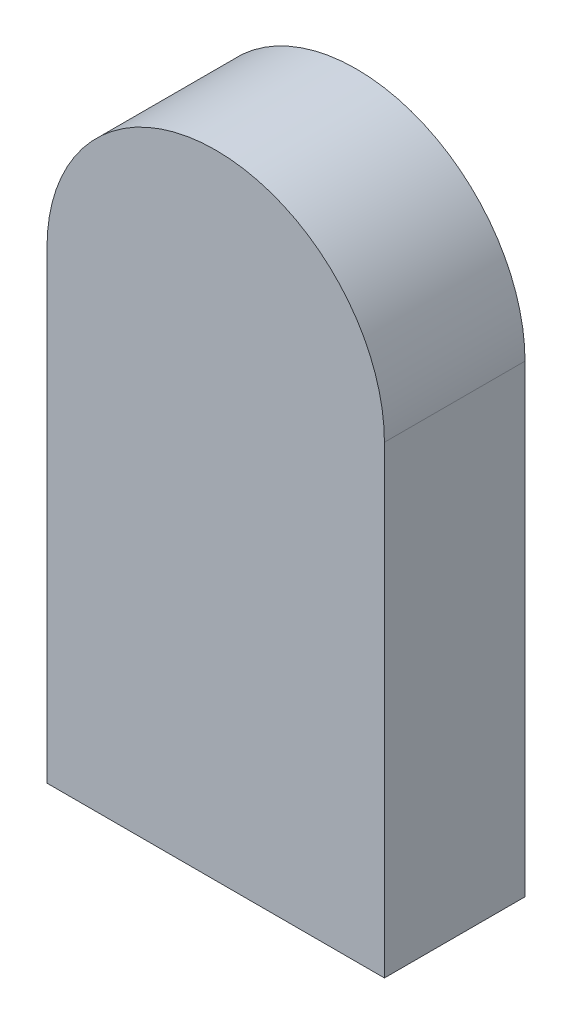
ISO-10303-21;
HEADER;
FILE_DESCRIPTION(('STEP AP214'),'2;1');
FILE_NAME('part.step','',(''),(''),'','','');
FILE_SCHEMA(('AUTOMOTIVE_DESIGN { 1 0 10303 214 1 1 1 1 }'));
ENDSEC;
DATA;
#1=APPLICATION_CONTEXT('core data for automotive mechanical design processes');
#2=APPLICATION_PROTOCOL_DEFINITION('international standard','automotive_design',2000,#1);
#3=PRODUCT_CONTEXT('',#1,'mechanical');
#4=PRODUCT('Part','Part','',(#3));
#5=PRODUCT_RELATED_PRODUCT_CATEGORY('part','',(#4));
#6=PRODUCT_DEFINITION_FORMATION('','',#4);
#7=PRODUCT_DEFINITION_CONTEXT('part definition',#1,'design');
#8=PRODUCT_DEFINITION('design','',#6,#7);
#9=PRODUCT_DEFINITION_SHAPE('','',#8);
#10=(LENGTH_UNIT() NAMED_UNIT(*) SI_UNIT(.MILLI.,.METRE.));
#11=(NAMED_UNIT(*) PLANE_ANGLE_UNIT() SI_UNIT($,.RADIAN.));
#12=(NAMED_UNIT(*) SI_UNIT($,.STERADIAN.) SOLID_ANGLE_UNIT());
#13=UNCERTAINTY_MEASURE_WITH_UNIT(LENGTH_MEASURE(1.E-05),#10,'distance_accuracy_value','');
#14=(GEOMETRIC_REPRESENTATION_CONTEXT(3) GLOBAL_UNCERTAINTY_ASSIGNED_CONTEXT((#13)) GLOBAL_UNIT_ASSIGNED_CONTEXT((#10,
#11,#12)) REPRESENTATION_CONTEXT('',''));
#15=CARTESIAN_POINT('',(0.,0.,0.));
#16=DIRECTION('',(0.,0.,1.));
#17=DIRECTION('',(1.,0.,0.));
#18=AXIS2_PLACEMENT_3D('',#15,#16,#17);
#19=CARTESIAN_POINT('',(1.13,-4.05,0.));
#20=DIRECTION('',(0.,1.,0.));
#21=DIRECTION('',(1.,0.,0.));
#22=AXIS2_PLACEMENT_3D('',#19,#20,#21);
#23=PLANE('',#22);
#24=DIRECTION('',(1.,0.,0.));
#25=VECTOR('',#24,1.);
#26=CARTESIAN_POINT('',(1.13,-4.05,0.));
#27=LINE('',#26,#25);
#28=CARTESIAN_POINT('',(1.13,-4.05,0.));
#29=VERTEX_POINT('',#28);
#30=CARTESIAN_POINT('',(1.37,-4.05,0.));
#31=VERTEX_POINT('',#30);
#32=EDGE_CURVE('E11',#29,#31,#27,.T.);
#33=ORIENTED_EDGE('',*,*,#32,.T.);
#34=DIRECTION('',(0.,0.,1.));
#35=VECTOR('',#34,1.);
#36=CARTESIAN_POINT('',(1.37,-4.05,0.));
#37=LINE('',#36,#35);
#38=CARTESIAN_POINT('',(1.37,-4.05,0.1));
#39=VERTEX_POINT('',#38);
#40=EDGE_CURVE('E24',#31,#39,#37,.T.);
#41=ORIENTED_EDGE('',*,*,#40,.T.);
#42=DIRECTION('',(1.,0.,0.));
#43=VECTOR('',#42,1.);
#44=CARTESIAN_POINT('',(1.13,-4.05,0.1));
#45=LINE('',#44,#43);
#46=CARTESIAN_POINT('',(1.13,-4.05,0.1));
#47=VERTEX_POINT('',#46);
#48=EDGE_CURVE('E87',#47,#39,#45,.T.);
#49=ORIENTED_EDGE('',*,*,#48,.F.);
#50=DIRECTION('',(0.,0.,1.));
#51=VECTOR('',#50,1.);
#52=CARTESIAN_POINT('',(1.13,-4.05,0.));
#53=LINE('',#52,#51);
#54=EDGE_CURVE('E36',#29,#47,#53,.T.);
#55=ORIENTED_EDGE('',*,*,#54,.F.);
#56=EDGE_LOOP('',(#33,#41,#49,#55));
#57=FACE_BOUND('',#56,.T.);
#58=ADVANCED_FACE('F17',(#57),#23,.F.);
#59=CARTESIAN_POINT('',(1.37,-4.05,0.));
#60=DIRECTION('',(-1.,0.,0.));
#61=DIRECTION('',(0.,1.,0.));
#62=AXIS2_PLACEMENT_3D('',#59,#60,#61);
#63=PLANE('',#62);
#64=DIRECTION('',(0.,1.,0.));
#65=VECTOR('',#64,1.);
#66=CARTESIAN_POINT('',(1.37,-4.05,0.));
#67=LINE('',#66,#65);
#68=CARTESIAN_POINT('',(1.37,-3.72,0.));
#69=VERTEX_POINT('',#68);
#70=EDGE_CURVE('E84',#31,#69,#67,.T.);
#71=ORIENTED_EDGE('',*,*,#70,.T.);
#72=DIRECTION('',(0.,0.,1.));
#73=VECTOR('',#72,1.);
#74=CARTESIAN_POINT('',(1.37,-3.72,0.));
#75=LINE('',#74,#73);
#76=CARTESIAN_POINT('',(1.37,-3.72,0.1));
#77=VERTEX_POINT('',#76);
#78=EDGE_CURVE('E82',#69,#77,#75,.T.);
#79=ORIENTED_EDGE('',*,*,#78,.T.);
#80=DIRECTION('',(0.,1.,0.));
#81=VECTOR('',#80,1.);
#82=CARTESIAN_POINT('',(1.37,-4.05,0.1));
#83=LINE('',#82,#81);
#84=EDGE_CURVE('E72',#39,#77,#83,.T.);
#85=ORIENTED_EDGE('',*,*,#84,.F.);
#86=ORIENTED_EDGE('',*,*,#40,.F.);
#87=EDGE_LOOP('',(#71,#79,#85,#86));
#88=FACE_BOUND('',#87,.T.);
#89=ADVANCED_FACE('F89',(#88),#63,.F.);
#90=CARTESIAN_POINT('',(1.25,-3.72,0.));
#91=DIRECTION('',(0.,0.,-1.));
#92=DIRECTION('',(1.,0.,0.));
#93=AXIS2_PLACEMENT_3D('',#90,#91,#92);
#94=CYLINDRICAL_SURFACE('',#93,0.12);
#95=CARTESIAN_POINT('',(1.25,-3.72,0.));
#96=DIRECTION('',(0.,0.,1.));
#97=DIRECTION('',(1.,0.,0.));
#98=AXIS2_PLACEMENT_3D('',#95,#96,#97);
#99=CIRCLE('',#98,0.12);
#100=CARTESIAN_POINT('',(1.13,-3.72,0.));
#101=VERTEX_POINT('',#100);
#102=EDGE_CURVE('E62',#69,#101,#99,.T.);
#103=ORIENTED_EDGE('',*,*,#102,.T.);
#104=DIRECTION('',(0.,0.,1.));
#105=VECTOR('',#104,1.);
#106=CARTESIAN_POINT('',(1.13,-3.72,0.));
#107=LINE('',#106,#105);
#108=CARTESIAN_POINT('',(1.13,-3.72,0.1));
#109=VERTEX_POINT('',#108);
#110=EDGE_CURVE('E57',#101,#109,#107,.T.);
#111=ORIENTED_EDGE('',*,*,#110,.T.);
#112=CARTESIAN_POINT('',(1.25,-3.72,0.1));
#113=DIRECTION('',(0.,0.,1.));
#114=DIRECTION('',(1.,0.,0.));
#115=AXIS2_PLACEMENT_3D('',#112,#113,#114);
#116=CIRCLE('',#115,0.12);
#117=EDGE_CURVE('E60',#77,#109,#116,.T.);
#118=ORIENTED_EDGE('',*,*,#117,.F.);
#119=ORIENTED_EDGE('',*,*,#78,.F.);
#120=EDGE_LOOP('',(#103,#111,#118,#119));
#121=FACE_BOUND('',#120,.T.);
#122=ADVANCED_FACE('F59',(#121),#94,.T.);
#123=CARTESIAN_POINT('',(1.13,-4.05,0.));
#124=DIRECTION('',(-1.,0.,0.));
#125=DIRECTION('',(0.,1.,0.));
#126=AXIS2_PLACEMENT_3D('',#123,#124,#125);
#127=PLANE('',#126);
#128=ORIENTED_EDGE('',*,*,#54,.T.);
#129=DIRECTION('',(0.,1.,0.));
#130=VECTOR('',#129,1.);
#131=CARTESIAN_POINT('',(1.13,-4.05,0.1));
#132=LINE('',#131,#130);
#133=EDGE_CURVE('E71',#47,#109,#132,.T.);
#134=ORIENTED_EDGE('',*,*,#133,.T.);
#135=ORIENTED_EDGE('',*,*,#110,.F.);
#136=DIRECTION('',(0.,1.,0.));
#137=VECTOR('',#136,1.);
#138=CARTESIAN_POINT('',(1.13,-4.05,0.));
#139=LINE('',#138,#137);
#140=EDGE_CURVE('E76',#29,#101,#139,.T.);
#141=ORIENTED_EDGE('',*,*,#140,.F.);
#142=EDGE_LOOP('',(#128,#134,#135,#141));
#143=FACE_BOUND('',#142,.T.);
#144=ADVANCED_FACE('F75',(#143),#127,.T.);
#145=CARTESIAN_POINT('',(1.25,-3.849490847913,0.));
#146=DIRECTION('',(0.,0.,1.));
#147=DIRECTION('',(1.,0.,0.));
#148=AXIS2_PLACEMENT_3D('',#145,#146,#147);
#149=PLANE('',#148);
#150=ORIENTED_EDGE('',*,*,#140,.T.);
#151=ORIENTED_EDGE('',*,*,#102,.F.);
#152=ORIENTED_EDGE('',*,*,#70,.F.);
#153=ORIENTED_EDGE('',*,*,#32,.F.);
#154=EDGE_LOOP('',(#150,#151,#152,#153));
#155=FACE_BOUND('',#154,.T.);
#156=ADVANCED_FACE('F91',(#155),#149,.F.);
#157=CARTESIAN_POINT('',(1.25,-3.849490847913,0.1));
#158=DIRECTION('',(0.,0.,1.));
#159=DIRECTION('',(1.,0.,0.));
#160=AXIS2_PLACEMENT_3D('',#157,#158,#159);
#161=PLANE('',#160);
#162=ORIENTED_EDGE('',*,*,#48,.T.);
#163=ORIENTED_EDGE('',*,*,#84,.T.);
#164=ORIENTED_EDGE('',*,*,#117,.T.);
#165=ORIENTED_EDGE('',*,*,#133,.F.);
#166=EDGE_LOOP('',(#162,#163,#164,#165));
#167=FACE_BOUND('',#166,.T.);
#168=ADVANCED_FACE('F70',(#167),#161,.T.);
#169=CLOSED_SHELL('',(#58,#89,#122,#144,#156,#168));
#170=MANIFOLD_SOLID_BREP('B1',#169);
#171=ADVANCED_BREP_SHAPE_REPRESENTATION('',(#18,#170),#14);
#172=SHAPE_DEFINITION_REPRESENTATION(#9,#171);
ENDSEC;
END-ISO-10303-21;
